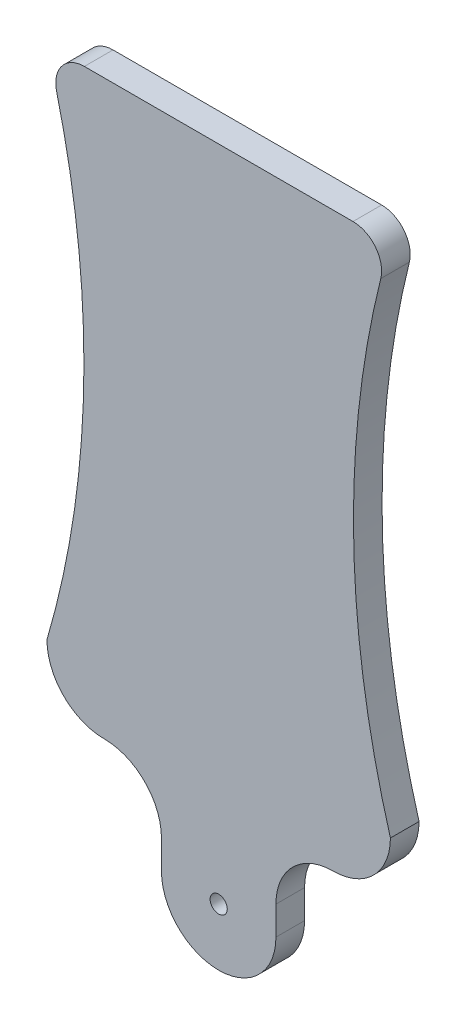
ISO-10303-21;
HEADER;
FILE_DESCRIPTION(('STEP AP214'),'2;1');
FILE_NAME('part.step','',(''),(''),'','','');
FILE_SCHEMA(('AUTOMOTIVE_DESIGN { 1 0 10303 214 1 1 1 1 }'));
ENDSEC;
DATA;
#1=APPLICATION_CONTEXT('core data for automotive mechanical design processes');
#2=APPLICATION_PROTOCOL_DEFINITION('international standard','automotive_design',2000,#1);
#3=PRODUCT_CONTEXT('',#1,'mechanical');
#4=PRODUCT('Part','Part','',(#3));
#5=PRODUCT_RELATED_PRODUCT_CATEGORY('part','',(#4));
#6=PRODUCT_DEFINITION_FORMATION('','',#4);
#7=PRODUCT_DEFINITION_CONTEXT('part definition',#1,'design');
#8=PRODUCT_DEFINITION('design','',#6,#7);
#9=PRODUCT_DEFINITION_SHAPE('','',#8);
#10=(LENGTH_UNIT() NAMED_UNIT(*) SI_UNIT(.MILLI.,.METRE.));
#11=(NAMED_UNIT(*) PLANE_ANGLE_UNIT() SI_UNIT($,.RADIAN.));
#12=(NAMED_UNIT(*) SI_UNIT($,.STERADIAN.) SOLID_ANGLE_UNIT());
#13=UNCERTAINTY_MEASURE_WITH_UNIT(LENGTH_MEASURE(1.E-05),#10,'distance_accuracy_value','');
#14=(GEOMETRIC_REPRESENTATION_CONTEXT(3) GLOBAL_UNCERTAINTY_ASSIGNED_CONTEXT((#13)) GLOBAL_UNIT_ASSIGNED_CONTEXT((#10,
#11,#12)) REPRESENTATION_CONTEXT('',''));
#15=CARTESIAN_POINT('',(0.,0.,0.));
#16=DIRECTION('',(0.,0.,1.));
#17=DIRECTION('',(1.,0.,0.));
#18=AXIS2_PLACEMENT_3D('',#15,#16,#17);
#19=CARTESIAN_POINT('',(-4.08966397750088,13.1353936637728,5.));
#20=DIRECTION('',(0.,0.,1.));
#21=DIRECTION('',(1.,0.,0.));
#22=AXIS2_PLACEMENT_3D('',#19,#20,#21);
#23=PLANE('',#22);
#24=CARTESIAN_POINT('',(-4.08966397750088,13.1353936637728,5.));
#25=DIRECTION('',(0.,0.,1.));
#26=DIRECTION('',(1.,0.,0.));
#27=AXIS2_PLACEMENT_3D('',#24,#25,#26);
#28=CIRCLE('',#27,1.5);
#29=CARTESIAN_POINT('',(-2.58966397750088,13.1353936637728,5.));
#30=VERTEX_POINT('',#29);
#31=EDGE_CURVE('E170',#30,#30,#28,.T.);
#32=ORIENTED_EDGE('',*,*,#31,.F.);
#33=EDGE_LOOP('',(#32));
#34=FACE_BOUND('',#33,.T.);
#35=CARTESIAN_POINT('',(179.45186135034,83.1353936637728,5.));
#36=DIRECTION('',(0.,0.,1.));
#37=DIRECTION('',(1.,0.,0.));
#38=AXIS2_PLACEMENT_3D('',#35,#36,#37);
#39=CIRCLE('',#38,160.);
#40=CARTESIAN_POINT('',(25.9103360224991,38.1353936637728,5.));
#41=VERTEX_POINT('',#40);
#42=CARTESIAN_POINT('',(24.2246071095436,121.923272451652,5.));
#43=VERTEX_POINT('',#42);
#44=EDGE_CURVE('E128',#41,#43,#39,.F.);
#45=ORIENTED_EDGE('',*,*,#44,.T.);
#46=CARTESIAN_POINT('',(19.3737554145187,123.135393663773,5.));
#47=DIRECTION('',(0.,0.,1.));
#48=DIRECTION('',(1.,0.,0.));
#49=AXIS2_PLACEMENT_3D('',#46,#47,#48);
#50=CIRCLE('',#49,5.);
#51=CARTESIAN_POINT('',(19.3737554145187,128.135393663773,5.));
#52=VERTEX_POINT('',#51);
#53=EDGE_CURVE('E42',#43,#52,#50,.T.);
#54=ORIENTED_EDGE('',*,*,#53,.T.);
#55=DIRECTION('',(-1.,0.,0.));
#56=VECTOR('',#55,1.);
#57=CARTESIAN_POINT('',(-34.0896639775009,128.135393663773,5.));
#58=LINE('',#57,#56);
#59=CARTESIAN_POINT('',(-27.5530833695205,128.135393663773,5.));
#60=VERTEX_POINT('',#59);
#61=EDGE_CURVE('E185',#52,#60,#58,.T.);
#62=ORIENTED_EDGE('',*,*,#61,.T.);
#63=CARTESIAN_POINT('',(-27.5530833695205,123.135393663773,5.));
#64=DIRECTION('',(0.,0.,1.));
#65=DIRECTION('',(1.,0.,0.));
#66=AXIS2_PLACEMENT_3D('',#63,#64,#65);
#67=CIRCLE('',#66,5.);
#68=CARTESIAN_POINT('',(-32.4039350645454,121.923272451652,5.));
#69=VERTEX_POINT('',#68);
#70=EDGE_CURVE('E49',#60,#69,#67,.T.);
#71=ORIENTED_EDGE('',*,*,#70,.T.);
#72=CARTESIAN_POINT('',(-187.631189305342,83.1353936637728,5.));
#73=DIRECTION('',(0.,0.,1.));
#74=DIRECTION('',(1.,0.,0.));
#75=AXIS2_PLACEMENT_3D('',#72,#73,#74);
#76=CIRCLE('',#75,160.);
#77=CARTESIAN_POINT('',(-34.0896639775009,38.1353936637728,5.));
#78=VERTEX_POINT('',#77);
#79=EDGE_CURVE('E142',#78,#69,#76,.T.);
#80=ORIENTED_EDGE('',*,*,#79,.F.);
#81=CARTESIAN_POINT('',(-24.0896639775009,38.1353936637728,5.));
#82=DIRECTION('',(0.,0.,1.));
#83=DIRECTION('',(1.,0.,0.));
#84=AXIS2_PLACEMENT_3D('',#81,#82,#83);
#85=CIRCLE('',#84,10.);
#86=CARTESIAN_POINT('',(-24.0896639775009,28.1353936637728,5.));
#87=VERTEX_POINT('',#86);
#88=EDGE_CURVE('E148',#78,#87,#85,.T.);
#89=ORIENTED_EDGE('',*,*,#88,.T.);
#90=CARTESIAN_POINT('',(-24.0896639775009,18.1353936637728,5.));
#91=DIRECTION('',(0.,0.,1.));
#92=DIRECTION('',(1.,0.,0.));
#93=AXIS2_PLACEMENT_3D('',#90,#91,#92);
#94=CIRCLE('',#93,10.);
#95=CARTESIAN_POINT('',(-14.0896639775009,18.1353936637728,5.));
#96=VERTEX_POINT('',#95);
#97=EDGE_CURVE('E166',#87,#96,#94,.F.);
#98=ORIENTED_EDGE('',*,*,#97,.T.);
#99=DIRECTION('',(0.,-1.,0.));
#100=VECTOR('',#99,1.);
#101=CARTESIAN_POINT('',(-14.0896639775009,13.1353936637728,5.));
#102=LINE('',#101,#100);
#103=CARTESIAN_POINT('',(-14.0896639775009,13.1353936637728,5.));
#104=VERTEX_POINT('',#103);
#105=EDGE_CURVE('E192',#96,#104,#102,.T.);
#106=ORIENTED_EDGE('',*,*,#105,.T.);
#107=CARTESIAN_POINT('',(-4.08966397750088,13.1353936637728,5.));
#108=DIRECTION('',(0.,0.,1.));
#109=DIRECTION('',(1.,0.,0.));
#110=AXIS2_PLACEMENT_3D('',#107,#108,#109);
#111=CIRCLE('',#110,10.);
#112=CARTESIAN_POINT('',(5.91033602249912,13.1353936637728,5.));
#113=VERTEX_POINT('',#112);
#114=EDGE_CURVE('E258',#104,#113,#111,.T.);
#115=ORIENTED_EDGE('',*,*,#114,.T.);
#116=DIRECTION('',(0.,1.,0.));
#117=VECTOR('',#116,1.);
#118=CARTESIAN_POINT('',(5.91033602249912,13.1353936637728,5.));
#119=LINE('',#118,#117);
#120=CARTESIAN_POINT('',(5.91033602249912,18.1353936637728,5.));
#121=VERTEX_POINT('',#120);
#122=EDGE_CURVE('E193',#113,#121,#119,.T.);
#123=ORIENTED_EDGE('',*,*,#122,.T.);
#124=CARTESIAN_POINT('',(15.9103360224991,18.1353936637728,5.));
#125=DIRECTION('',(0.,0.,1.));
#126=DIRECTION('',(1.,0.,0.));
#127=AXIS2_PLACEMENT_3D('',#124,#125,#126);
#128=CIRCLE('',#127,10.);
#129=CARTESIAN_POINT('',(15.9103360224991,28.1353936637728,5.));
#130=VERTEX_POINT('',#129);
#131=EDGE_CURVE('E162',#121,#130,#128,.F.);
#132=ORIENTED_EDGE('',*,*,#131,.T.);
#133=CARTESIAN_POINT('',(15.9103360224991,38.1353936637728,5.));
#134=DIRECTION('',(0.,0.,1.));
#135=DIRECTION('',(1.,0.,0.));
#136=AXIS2_PLACEMENT_3D('',#133,#134,#135);
#137=CIRCLE('',#136,10.);
#138=EDGE_CURVE('E150',#130,#41,#137,.T.);
#139=ORIENTED_EDGE('',*,*,#138,.T.);
#140=EDGE_LOOP('',(#45,#54,#62,#71,#80,#89,#98,#106,#115,#123,#132,#139));
#141=FACE_BOUND('',#140,.T.);
#142=ADVANCED_FACE('F34',(#34,#141),#23,.T.);
#143=CARTESIAN_POINT('',(-4.08966397750088,13.1353936637728,0.));
#144=DIRECTION('',(0.,0.,1.));
#145=DIRECTION('',(1.,0.,0.));
#146=AXIS2_PLACEMENT_3D('',#143,#144,#145);
#147=PLANE('',#146);
#148=CARTESIAN_POINT('',(-4.08966397750088,13.1353936637728,0.));
#149=DIRECTION('',(0.,0.,1.));
#150=DIRECTION('',(1.,0.,0.));
#151=AXIS2_PLACEMENT_3D('',#148,#149,#150);
#152=CIRCLE('',#151,1.5);
#153=CARTESIAN_POINT('',(-2.58966397750088,13.1353936637728,0.));
#154=VERTEX_POINT('',#153);
#155=EDGE_CURVE('E282',#154,#154,#152,.T.);
#156=ORIENTED_EDGE('',*,*,#155,.T.);
#157=EDGE_LOOP('',(#156));
#158=FACE_BOUND('',#157,.T.);
#159=DIRECTION('',(-1.,0.,0.));
#160=VECTOR('',#159,1.);
#161=CARTESIAN_POINT('',(-34.0896639775009,128.135393663773,0.));
#162=LINE('',#161,#160);
#163=CARTESIAN_POINT('',(19.3737554145187,128.135393663773,0.));
#164=VERTEX_POINT('',#163);
#165=CARTESIAN_POINT('',(-27.5530833695205,128.135393663773,0.));
#166=VERTEX_POINT('',#165);
#167=EDGE_CURVE('E259',#164,#166,#162,.T.);
#168=ORIENTED_EDGE('',*,*,#167,.F.);
#169=CARTESIAN_POINT('',(19.3737554145187,123.135393663773,0.));
#170=DIRECTION('',(0.,0.,1.));
#171=DIRECTION('',(1.,0.,0.));
#172=AXIS2_PLACEMENT_3D('',#169,#170,#171);
#173=CIRCLE('',#172,5.);
#174=CARTESIAN_POINT('',(24.2246071095436,121.923272451652,0.));
#175=VERTEX_POINT('',#174);
#176=EDGE_CURVE('E141',#164,#175,#173,.F.);
#177=ORIENTED_EDGE('',*,*,#176,.T.);
#178=CARTESIAN_POINT('',(179.45186135034,83.1353936637728,0.));
#179=DIRECTION('',(0.,0.,1.));
#180=DIRECTION('',(1.,0.,0.));
#181=AXIS2_PLACEMENT_3D('',#178,#179,#180);
#182=CIRCLE('',#181,160.);
#183=CARTESIAN_POINT('',(25.9103360224991,38.1353936637728,0.));
#184=VERTEX_POINT('',#183);
#185=EDGE_CURVE('E127',#184,#175,#182,.F.);
#186=ORIENTED_EDGE('',*,*,#185,.F.);
#187=CARTESIAN_POINT('',(15.9103360224991,38.1353936637728,0.));
#188=DIRECTION('',(0.,0.,1.));
#189=DIRECTION('',(1.,0.,0.));
#190=AXIS2_PLACEMENT_3D('',#187,#188,#189);
#191=CIRCLE('',#190,10.);
#192=CARTESIAN_POINT('',(15.9103360224991,28.1353936637728,0.));
#193=VERTEX_POINT('',#192);
#194=EDGE_CURVE('E139',#184,#193,#191,.F.);
#195=ORIENTED_EDGE('',*,*,#194,.T.);
#196=CARTESIAN_POINT('',(15.9103360224991,18.1353936637728,0.));
#197=DIRECTION('',(0.,0.,1.));
#198=DIRECTION('',(1.,0.,0.));
#199=AXIS2_PLACEMENT_3D('',#196,#197,#198);
#200=CIRCLE('',#199,10.);
#201=CARTESIAN_POINT('',(5.91033602249912,18.1353936637728,0.));
#202=VERTEX_POINT('',#201);
#203=EDGE_CURVE('E160',#193,#202,#200,.T.);
#204=ORIENTED_EDGE('',*,*,#203,.T.);
#205=DIRECTION('',(0.,1.,0.));
#206=VECTOR('',#205,1.);
#207=CARTESIAN_POINT('',(5.91033602249912,13.1353936637728,0.));
#208=LINE('',#207,#206);
#209=CARTESIAN_POINT('',(5.91033602249912,13.1353936637728,0.));
#210=VERTEX_POINT('',#209);
#211=EDGE_CURVE('E263',#210,#202,#208,.T.);
#212=ORIENTED_EDGE('',*,*,#211,.F.);
#213=CARTESIAN_POINT('',(-4.08966397750088,13.1353936637728,0.));
#214=DIRECTION('',(0.,0.,1.));
#215=DIRECTION('',(1.,0.,0.));
#216=AXIS2_PLACEMENT_3D('',#213,#214,#215);
#217=CIRCLE('',#216,10.);
#218=CARTESIAN_POINT('',(-14.0896639775009,13.1353936637728,0.));
#219=VERTEX_POINT('',#218);
#220=EDGE_CURVE('E257',#219,#210,#217,.T.);
#221=ORIENTED_EDGE('',*,*,#220,.F.);
#222=DIRECTION('',(0.,-1.,0.));
#223=VECTOR('',#222,1.);
#224=CARTESIAN_POINT('',(-14.0896639775009,13.1353936637728,0.));
#225=LINE('',#224,#223);
#226=CARTESIAN_POINT('',(-14.0896639775009,18.1353936637728,0.));
#227=VERTEX_POINT('',#226);
#228=EDGE_CURVE('E253',#227,#219,#225,.T.);
#229=ORIENTED_EDGE('',*,*,#228,.F.);
#230=CARTESIAN_POINT('',(-24.0896639775009,18.1353936637728,0.));
#231=DIRECTION('',(0.,0.,1.));
#232=DIRECTION('',(1.,0.,0.));
#233=AXIS2_PLACEMENT_3D('',#230,#231,#232);
#234=CIRCLE('',#233,10.);
#235=CARTESIAN_POINT('',(-24.0896639775009,28.1353936637728,0.));
#236=VERTEX_POINT('',#235);
#237=EDGE_CURVE('E164',#227,#236,#234,.T.);
#238=ORIENTED_EDGE('',*,*,#237,.T.);
#239=CARTESIAN_POINT('',(-24.0896639775009,38.1353936637728,0.));
#240=DIRECTION('',(0.,0.,1.));
#241=DIRECTION('',(1.,0.,0.));
#242=AXIS2_PLACEMENT_3D('',#239,#240,#241);
#243=CIRCLE('',#242,10.);
#244=CARTESIAN_POINT('',(-34.0896639775009,38.1353936637728,0.));
#245=VERTEX_POINT('',#244);
#246=EDGE_CURVE('E133',#236,#245,#243,.F.);
#247=ORIENTED_EDGE('',*,*,#246,.T.);
#248=CARTESIAN_POINT('',(-187.631189305342,83.1353936637728,0.));
#249=DIRECTION('',(0.,0.,1.));
#250=DIRECTION('',(1.,0.,0.));
#251=AXIS2_PLACEMENT_3D('',#248,#249,#250);
#252=CIRCLE('',#251,160.);
#253=CARTESIAN_POINT('',(-32.4039350645454,121.923272451652,0.));
#254=VERTEX_POINT('',#253);
#255=EDGE_CURVE('E174',#245,#254,#252,.T.);
#256=ORIENTED_EDGE('',*,*,#255,.T.);
#257=CARTESIAN_POINT('',(-27.5530833695205,123.135393663773,0.));
#258=DIRECTION('',(0.,0.,1.));
#259=DIRECTION('',(1.,0.,0.));
#260=AXIS2_PLACEMENT_3D('',#257,#258,#259);
#261=CIRCLE('',#260,5.);
#262=EDGE_CURVE('E179',#254,#166,#261,.F.);
#263=ORIENTED_EDGE('',*,*,#262,.T.);
#264=EDGE_LOOP('',(#168,#177,#186,#195,#204,#212,#221,#229,#238,#247,#256,#263));
#265=FACE_BOUND('',#264,.T.);
#266=ADVANCED_FACE('F138',(#158,#265),#147,.F.);
#267=CARTESIAN_POINT('',(-4.08966397750088,13.1353936637728,5.));
#268=DIRECTION('',(0.,0.,-1.));
#269=DIRECTION('',(-1.,0.,0.));
#270=AXIS2_PLACEMENT_3D('',#267,#268,#269);
#271=CYLINDRICAL_SURFACE('',#270,10.);
#272=ORIENTED_EDGE('',*,*,#220,.T.);
#273=DIRECTION('',(0.,0.,-1.));
#274=VECTOR('',#273,1.);
#275=CARTESIAN_POINT('',(5.91033602249912,13.1353936637728,5.));
#276=LINE('',#275,#274);
#277=EDGE_CURVE('E269',#113,#210,#276,.T.);
#278=ORIENTED_EDGE('',*,*,#277,.F.);
#279=ORIENTED_EDGE('',*,*,#114,.F.);
#280=DIRECTION('',(0.,0.,-1.));
#281=VECTOR('',#280,1.);
#282=CARTESIAN_POINT('',(-14.0896639775009,13.1353936637728,5.));
#283=LINE('',#282,#281);
#284=EDGE_CURVE('E267',#104,#219,#283,.T.);
#285=ORIENTED_EDGE('',*,*,#284,.T.);
#286=EDGE_LOOP('',(#272,#278,#279,#285));
#287=FACE_BOUND('',#286,.T.);
#288=ADVANCED_FACE('F211',(#287),#271,.T.);
#289=CARTESIAN_POINT('',(5.91033602249912,13.1353936637728,5.));
#290=DIRECTION('',(-1.,0.,0.));
#291=DIRECTION('',(0.,0.,1.));
#292=AXIS2_PLACEMENT_3D('',#289,#290,#291);
#293=PLANE('',#292);
#294=ORIENTED_EDGE('',*,*,#211,.T.);
#295=DIRECTION('',(0.,0.,-1.));
#296=VECTOR('',#295,1.);
#297=CARTESIAN_POINT('',(5.91033602249912,18.1353936637728,5.));
#298=LINE('',#297,#296);
#299=EDGE_CURVE('E134',#202,#121,#298,.F.);
#300=ORIENTED_EDGE('',*,*,#299,.T.);
#301=ORIENTED_EDGE('',*,*,#122,.F.);
#302=ORIENTED_EDGE('',*,*,#277,.T.);
#303=EDGE_LOOP('',(#294,#300,#301,#302));
#304=FACE_BOUND('',#303,.T.);
#305=ADVANCED_FACE('F225',(#304),#293,.F.);
#306=CARTESIAN_POINT('',(-34.0896639775009,128.135393663773,5.));
#307=DIRECTION('',(0.,-1.,0.));
#308=DIRECTION('',(0.,0.,-1.));
#309=AXIS2_PLACEMENT_3D('',#306,#307,#308);
#310=PLANE('',#309);
#311=ORIENTED_EDGE('',*,*,#61,.F.);
#312=DIRECTION('',(0.,0.,-1.));
#313=VECTOR('',#312,1.);
#314=CARTESIAN_POINT('',(19.3737554145187,128.135393663773,0.));
#315=LINE('',#314,#313);
#316=EDGE_CURVE('E176',#52,#164,#315,.T.);
#317=ORIENTED_EDGE('',*,*,#316,.T.);
#318=ORIENTED_EDGE('',*,*,#167,.T.);
#319=DIRECTION('',(0.,0.,1.));
#320=VECTOR('',#319,1.);
#321=CARTESIAN_POINT('',(-27.5530833695205,128.135393663773,5.));
#322=LINE('',#321,#320);
#323=EDGE_CURVE('E168',#166,#60,#322,.T.);
#324=ORIENTED_EDGE('',*,*,#323,.T.);
#325=EDGE_LOOP('',(#311,#317,#318,#324));
#326=FACE_BOUND('',#325,.T.);
#327=ADVANCED_FACE('F189',(#326),#310,.F.);
#328=CARTESIAN_POINT('',(-14.0896639775009,13.1353936637728,5.));
#329=DIRECTION('',(1.,0.,0.));
#330=DIRECTION('',(0.,0.,-1.));
#331=AXIS2_PLACEMENT_3D('',#328,#329,#330);
#332=PLANE('',#331);
#333=ORIENTED_EDGE('',*,*,#105,.F.);
#334=DIRECTION('',(0.,0.,-1.));
#335=VECTOR('',#334,1.);
#336=CARTESIAN_POINT('',(-14.0896639775009,18.1353936637728,0.));
#337=LINE('',#336,#335);
#338=EDGE_CURVE('E158',#96,#227,#337,.T.);
#339=ORIENTED_EDGE('',*,*,#338,.T.);
#340=ORIENTED_EDGE('',*,*,#228,.T.);
#341=ORIENTED_EDGE('',*,*,#284,.F.);
#342=EDGE_LOOP('',(#333,#339,#340,#341));
#343=FACE_BOUND('',#342,.T.);
#344=ADVANCED_FACE('F219',(#343),#332,.F.);
#345=CARTESIAN_POINT('',(-4.08966397750088,13.1353936637728,0.));
#346=DIRECTION('',(0.,0.,1.));
#347=DIRECTION('',(1.,0.,0.));
#348=AXIS2_PLACEMENT_3D('',#345,#346,#347);
#349=CYLINDRICAL_SURFACE('',#348,1.5);
#350=ORIENTED_EDGE('',*,*,#155,.F.);
#351=EDGE_LOOP('',(#350));
#352=FACE_BOUND('',#351,.T.);
#353=ORIENTED_EDGE('',*,*,#31,.T.);
#354=EDGE_LOOP('',(#353));
#355=FACE_BOUND('',#354,.T.);
#356=ADVANCED_FACE('F216',(#352,#355),#349,.F.);
#357=CARTESIAN_POINT('',(15.9103360224991,38.1353936637728,5.));
#358=DIRECTION('',(0.,0.,-1.));
#359=DIRECTION('',(-1.,0.,0.));
#360=AXIS2_PLACEMENT_3D('',#357,#358,#359);
#361=CYLINDRICAL_SURFACE('',#360,10.);
#362=DIRECTION('',(0.,0.,-1.));
#363=VECTOR('',#362,1.);
#364=CARTESIAN_POINT('',(25.9103360224991,38.1353936637728,5.));
#365=LINE('',#364,#363);
#366=EDGE_CURVE('E124',#41,#184,#365,.T.);
#367=ORIENTED_EDGE('',*,*,#366,.F.);
#368=ORIENTED_EDGE('',*,*,#138,.F.);
#369=DIRECTION('',(0.,0.,-1.));
#370=VECTOR('',#369,1.);
#371=CARTESIAN_POINT('',(15.9103360224991,28.1353936637728,5.));
#372=LINE('',#371,#370);
#373=EDGE_CURVE('E146',#193,#130,#372,.F.);
#374=ORIENTED_EDGE('',*,*,#373,.F.);
#375=ORIENTED_EDGE('',*,*,#194,.F.);
#376=EDGE_LOOP('',(#367,#368,#374,#375));
#377=FACE_BOUND('',#376,.T.);
#378=ADVANCED_FACE('F144',(#377),#361,.T.);
#379=CARTESIAN_POINT('',(15.9103360224991,18.1353936637728,5.));
#380=DIRECTION('',(0.,0.,1.));
#381=DIRECTION('',(1.,0.,0.));
#382=AXIS2_PLACEMENT_3D('',#379,#380,#381);
#383=CYLINDRICAL_SURFACE('',#382,10.);
#384=ORIENTED_EDGE('',*,*,#131,.F.);
#385=ORIENTED_EDGE('',*,*,#299,.F.);
#386=ORIENTED_EDGE('',*,*,#203,.F.);
#387=ORIENTED_EDGE('',*,*,#373,.T.);
#388=EDGE_LOOP('',(#384,#385,#386,#387));
#389=FACE_BOUND('',#388,.T.);
#390=ADVANCED_FACE('F232',(#389),#383,.F.);
#391=CARTESIAN_POINT('',(-24.0896639775009,18.1353936637728,5.));
#392=DIRECTION('',(0.,0.,1.));
#393=DIRECTION('',(1.,0.,0.));
#394=AXIS2_PLACEMENT_3D('',#391,#392,#393);
#395=CYLINDRICAL_SURFACE('',#394,10.);
#396=ORIENTED_EDGE('',*,*,#338,.F.);
#397=ORIENTED_EDGE('',*,*,#97,.F.);
#398=DIRECTION('',(0.,0.,-1.));
#399=VECTOR('',#398,1.);
#400=CARTESIAN_POINT('',(-24.0896639775009,28.1353936637728,5.));
#401=LINE('',#400,#399);
#402=EDGE_CURVE('E171',#236,#87,#401,.F.);
#403=ORIENTED_EDGE('',*,*,#402,.F.);
#404=ORIENTED_EDGE('',*,*,#237,.F.);
#405=EDGE_LOOP('',(#396,#397,#403,#404));
#406=FACE_BOUND('',#405,.T.);
#407=ADVANCED_FACE('F235',(#406),#395,.F.);
#408=CARTESIAN_POINT('',(-24.0896639775009,38.1353936637728,5.));
#409=DIRECTION('',(0.,0.,-1.));
#410=DIRECTION('',(-1.,0.,0.));
#411=AXIS2_PLACEMENT_3D('',#408,#409,#410);
#412=CYLINDRICAL_SURFACE('',#411,10.);
#413=ORIENTED_EDGE('',*,*,#88,.F.);
#414=DIRECTION('',(0.,0.,-1.));
#415=VECTOR('',#414,1.);
#416=CARTESIAN_POINT('',(-34.0896639775009,38.1353936637728,5.));
#417=LINE('',#416,#415);
#418=EDGE_CURVE('E156',#245,#78,#417,.F.);
#419=ORIENTED_EDGE('',*,*,#418,.F.);
#420=ORIENTED_EDGE('',*,*,#246,.F.);
#421=ORIENTED_EDGE('',*,*,#402,.T.);
#422=EDGE_LOOP('',(#413,#419,#420,#421));
#423=FACE_BOUND('',#422,.T.);
#424=ADVANCED_FACE('F239',(#423),#412,.T.);
#425=CARTESIAN_POINT('',(-187.631189305342,83.1353936637728,0.));
#426=DIRECTION('',(0.,0.,1.));
#427=DIRECTION('',(1.,0.,0.));
#428=AXIS2_PLACEMENT_3D('',#425,#426,#427);
#429=CYLINDRICAL_SURFACE('',#428,160.);
#430=ORIENTED_EDGE('',*,*,#79,.T.);
#431=DIRECTION('',(0.,0.,1.));
#432=VECTOR('',#431,1.);
#433=CARTESIAN_POINT('',(-32.4039350645454,121.923272451652,0.));
#434=LINE('',#433,#432);
#435=EDGE_CURVE('E11',#69,#254,#434,.F.);
#436=ORIENTED_EDGE('',*,*,#435,.T.);
#437=ORIENTED_EDGE('',*,*,#255,.F.);
#438=ORIENTED_EDGE('',*,*,#418,.T.);
#439=EDGE_LOOP('',(#430,#436,#437,#438));
#440=FACE_BOUND('',#439,.T.);
#441=ADVANCED_FACE('F202',(#440),#429,.F.);
#442=CARTESIAN_POINT('',(179.45186135034,83.1353936637728,0.));
#443=DIRECTION('',(0.,0.,1.));
#444=DIRECTION('',(1.,0.,0.));
#445=AXIS2_PLACEMENT_3D('',#442,#443,#444);
#446=CYLINDRICAL_SURFACE('',#445,160.);
#447=ORIENTED_EDGE('',*,*,#185,.T.);
#448=DIRECTION('',(0.,0.,1.));
#449=VECTOR('',#448,1.);
#450=CARTESIAN_POINT('',(24.2246071095436,121.923272451652,0.));
#451=LINE('',#450,#449);
#452=EDGE_CURVE('E57',#175,#43,#451,.T.);
#453=ORIENTED_EDGE('',*,*,#452,.T.);
#454=ORIENTED_EDGE('',*,*,#44,.F.);
#455=ORIENTED_EDGE('',*,*,#366,.T.);
#456=EDGE_LOOP('',(#447,#453,#454,#455));
#457=FACE_BOUND('',#456,.T.);
#458=ADVANCED_FACE('F126',(#457),#446,.F.);
#459=CARTESIAN_POINT('',(19.3737554145187,123.135393663773,0.));
#460=DIRECTION('',(0.,0.,1.));
#461=DIRECTION('',(1.,0.,0.));
#462=AXIS2_PLACEMENT_3D('',#459,#460,#461);
#463=CYLINDRICAL_SURFACE('',#462,5.);
#464=ORIENTED_EDGE('',*,*,#53,.F.);
#465=ORIENTED_EDGE('',*,*,#452,.F.);
#466=ORIENTED_EDGE('',*,*,#176,.F.);
#467=ORIENTED_EDGE('',*,*,#316,.F.);
#468=EDGE_LOOP('',(#464,#465,#466,#467));
#469=FACE_BOUND('',#468,.T.);
#470=ADVANCED_FACE('F195',(#469),#463,.T.);
#471=CARTESIAN_POINT('',(-27.5530833695205,123.135393663773,0.));
#472=DIRECTION('',(0.,0.,1.));
#473=DIRECTION('',(1.,0.,0.));
#474=AXIS2_PLACEMENT_3D('',#471,#472,#473);
#475=CYLINDRICAL_SURFACE('',#474,5.);
#476=ORIENTED_EDGE('',*,*,#70,.F.);
#477=ORIENTED_EDGE('',*,*,#323,.F.);
#478=ORIENTED_EDGE('',*,*,#262,.F.);
#479=ORIENTED_EDGE('',*,*,#435,.F.);
#480=EDGE_LOOP('',(#476,#477,#478,#479));
#481=FACE_BOUND('',#480,.T.);
#482=ADVANCED_FACE('F36',(#481),#475,.T.);
#483=CLOSED_SHELL('',(#142,#266,#288,#305,#327,#344,#356,#378,#390,#407,#424,#441,#458,#470,#482));
#484=MANIFOLD_SOLID_BREP('B2',#483);
#485=ADVANCED_BREP_SHAPE_REPRESENTATION('',(#18,#484),#14);
#486=SHAPE_DEFINITION_REPRESENTATION(#9,#485);
ENDSEC;
END-ISO-10303-21;
